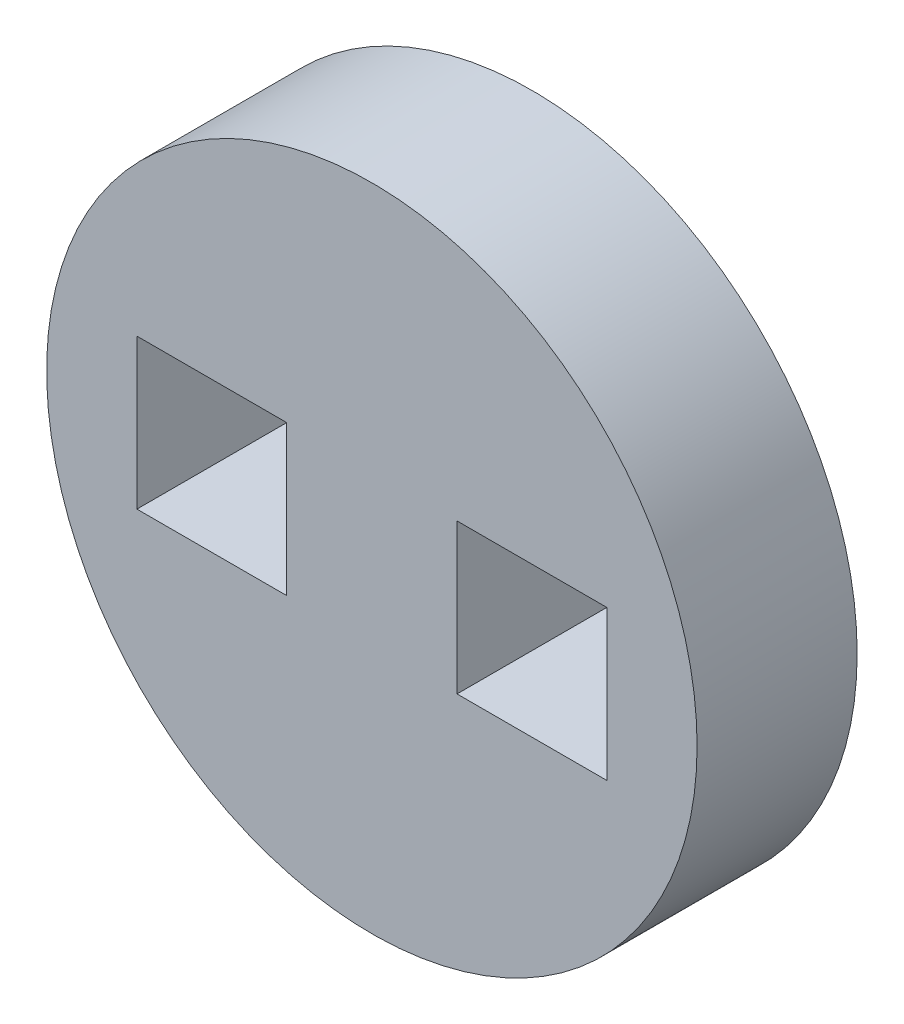
ISO-10303-21;
HEADER;
FILE_DESCRIPTION(('STEP AP214'),'2;1');
FILE_NAME('part.step','',(''),(''),'','','');
FILE_SCHEMA(('AUTOMOTIVE_DESIGN { 1 0 10303 214 1 1 1 1 }'));
ENDSEC;
DATA;
#1=APPLICATION_CONTEXT('core data for automotive mechanical design processes');
#2=APPLICATION_PROTOCOL_DEFINITION('international standard','automotive_design',2000,#1);
#3=PRODUCT_CONTEXT('',#1,'mechanical');
#4=PRODUCT('Part','Part','',(#3));
#5=PRODUCT_RELATED_PRODUCT_CATEGORY('part','',(#4));
#6=PRODUCT_DEFINITION_FORMATION('','',#4);
#7=PRODUCT_DEFINITION_CONTEXT('part definition',#1,'design');
#8=PRODUCT_DEFINITION('design','',#6,#7);
#9=PRODUCT_DEFINITION_SHAPE('','',#8);
#10=(LENGTH_UNIT() NAMED_UNIT(*) SI_UNIT(.MILLI.,.METRE.));
#11=(NAMED_UNIT(*) PLANE_ANGLE_UNIT() SI_UNIT($,.RADIAN.));
#12=(NAMED_UNIT(*) SI_UNIT($,.STERADIAN.) SOLID_ANGLE_UNIT());
#13=UNCERTAINTY_MEASURE_WITH_UNIT(LENGTH_MEASURE(1.E-05),#10,'distance_accuracy_value','');
#14=(GEOMETRIC_REPRESENTATION_CONTEXT(3) GLOBAL_UNCERTAINTY_ASSIGNED_CONTEXT((#13)) GLOBAL_UNIT_ASSIGNED_CONTEXT((#10,
#11,#12)) REPRESENTATION_CONTEXT('',''));
#15=CARTESIAN_POINT('',(0.,0.,0.));
#16=DIRECTION('',(0.,0.,1.));
#17=DIRECTION('',(1.,0.,0.));
#18=AXIS2_PLACEMENT_3D('',#15,#16,#17);
#19=CARTESIAN_POINT('',(0.,0.,3.175));
#20=DIRECTION('',(0.,0.,1.));
#21=DIRECTION('',(1.,0.,0.));
#22=AXIS2_PLACEMENT_3D('',#19,#20,#21);
#23=PLANE('',#22);
#24=CARTESIAN_POINT('',(0.,0.,3.175));
#25=DIRECTION('',(0.,0.,1.));
#26=DIRECTION('',(1.,0.,0.));
#27=AXIS2_PLACEMENT_3D('',#24,#25,#26);
#28=CIRCLE('',#27,6.4516);
#29=CARTESIAN_POINT('',(6.4516,0.,3.175));
#30=VERTEX_POINT('',#29);
#31=EDGE_CURVE('E12',#30,#30,#28,.T.);
#32=ORIENTED_EDGE('',*,*,#31,.T.);
#33=EDGE_LOOP('',(#32));
#34=FACE_BOUND('',#33,.T.);
#35=DIRECTION('',(0.,1.,0.));
#36=VECTOR('',#35,1.);
#37=CARTESIAN_POINT('',(-1.6891,-1.4859,3.175));
#38=LINE('',#37,#36);
#39=CARTESIAN_POINT('',(-1.6891,-1.4859,3.175));
#40=VERTEX_POINT('',#39);
#41=CARTESIAN_POINT('',(-1.6891,1.4859,3.175));
#42=VERTEX_POINT('',#41);
#43=EDGE_CURVE('E155',#40,#42,#38,.T.);
#44=ORIENTED_EDGE('',*,*,#43,.F.);
#45=DIRECTION('',(1.,0.,0.));
#46=VECTOR('',#45,1.);
#47=CARTESIAN_POINT('',(-4.6609,-1.4859,3.175));
#48=LINE('',#47,#46);
#49=CARTESIAN_POINT('',(-4.6609,-1.4859,3.175));
#50=VERTEX_POINT('',#49);
#51=EDGE_CURVE('E151',#50,#40,#48,.T.);
#52=ORIENTED_EDGE('',*,*,#51,.F.);
#53=DIRECTION('',(0.,-1.,0.));
#54=VECTOR('',#53,1.);
#55=CARTESIAN_POINT('',(-4.6609,-1.4859,3.175));
#56=LINE('',#55,#54);
#57=CARTESIAN_POINT('',(-4.6609,1.4859,3.175));
#58=VERTEX_POINT('',#57);
#59=EDGE_CURVE('E162',#58,#50,#56,.T.);
#60=ORIENTED_EDGE('',*,*,#59,.F.);
#61=DIRECTION('',(-1.,0.,0.));
#62=VECTOR('',#61,1.);
#63=CARTESIAN_POINT('',(-4.6609,1.4859,3.175));
#64=LINE('',#63,#62);
#65=EDGE_CURVE('E167',#42,#58,#64,.T.);
#66=ORIENTED_EDGE('',*,*,#65,.F.);
#67=EDGE_LOOP('',(#44,#52,#60,#66));
#68=FACE_BOUND('',#67,.T.);
#69=DIRECTION('',(0.,1.,0.));
#70=VECTOR('',#69,1.);
#71=CARTESIAN_POINT('',(4.6609,-1.4859,3.175));
#72=LINE('',#71,#70);
#73=CARTESIAN_POINT('',(4.6609,-1.4859,3.175));
#74=VERTEX_POINT('',#73);
#75=CARTESIAN_POINT('',(4.6609,1.4859,3.175));
#76=VERTEX_POINT('',#75);
#77=EDGE_CURVE('E111',#74,#76,#72,.T.);
#78=ORIENTED_EDGE('',*,*,#77,.F.);
#79=DIRECTION('',(1.,0.,0.));
#80=VECTOR('',#79,1.);
#81=CARTESIAN_POINT('',(1.6891,-1.4859,3.175));
#82=LINE('',#81,#80);
#83=CARTESIAN_POINT('',(1.6891,-1.4859,3.175));
#84=VERTEX_POINT('',#83);
#85=EDGE_CURVE('E102',#84,#74,#82,.T.);
#86=ORIENTED_EDGE('',*,*,#85,.F.);
#87=DIRECTION('',(0.,-1.,0.));
#88=VECTOR('',#87,1.);
#89=CARTESIAN_POINT('',(1.6891,-1.4859,3.175));
#90=LINE('',#89,#88);
#91=CARTESIAN_POINT('',(1.6891,1.4859,3.175));
#92=VERTEX_POINT('',#91);
#93=EDGE_CURVE('E128',#92,#84,#90,.T.);
#94=ORIENTED_EDGE('',*,*,#93,.F.);
#95=DIRECTION('',(-1.,0.,0.));
#96=VECTOR('',#95,1.);
#97=CARTESIAN_POINT('',(1.6891,1.4859,3.175));
#98=LINE('',#97,#96);
#99=EDGE_CURVE('E123',#76,#92,#98,.T.);
#100=ORIENTED_EDGE('',*,*,#99,.F.);
#101=EDGE_LOOP('',(#78,#86,#94,#100));
#102=FACE_BOUND('',#101,.T.);
#103=ADVANCED_FACE('F36',(#34,#68,#102),#23,.T.);
#104=CARTESIAN_POINT('',(0.,0.,0.));
#105=DIRECTION('',(0.,0.,1.));
#106=DIRECTION('',(1.,0.,0.));
#107=AXIS2_PLACEMENT_3D('',#104,#105,#106);
#108=PLANE('',#107);
#109=DIRECTION('',(1.,0.,0.));
#110=VECTOR('',#109,1.);
#111=CARTESIAN_POINT('',(-4.6609,-1.4859,0.));
#112=LINE('',#111,#110);
#113=CARTESIAN_POINT('',(-4.6609,-1.4859,0.));
#114=VERTEX_POINT('',#113);
#115=CARTESIAN_POINT('',(-1.6891,-1.4859,0.));
#116=VERTEX_POINT('',#115);
#117=EDGE_CURVE('E119',#114,#116,#112,.T.);
#118=ORIENTED_EDGE('',*,*,#117,.T.);
#119=DIRECTION('',(0.,1.,0.));
#120=VECTOR('',#119,1.);
#121=CARTESIAN_POINT('',(-1.6891,-1.4859,0.));
#122=LINE('',#121,#120);
#123=CARTESIAN_POINT('',(-1.6891,1.4859,0.));
#124=VERTEX_POINT('',#123);
#125=EDGE_CURVE('E171',#116,#124,#122,.T.);
#126=ORIENTED_EDGE('',*,*,#125,.T.);
#127=DIRECTION('',(-1.,0.,0.));
#128=VECTOR('',#127,1.);
#129=CARTESIAN_POINT('',(-4.6609,1.4859,0.));
#130=LINE('',#129,#128);
#131=CARTESIAN_POINT('',(-4.6609,1.4859,0.));
#132=VERTEX_POINT('',#131);
#133=EDGE_CURVE('E174',#124,#132,#130,.T.);
#134=ORIENTED_EDGE('',*,*,#133,.T.);
#135=DIRECTION('',(0.,-1.,0.));
#136=VECTOR('',#135,1.);
#137=CARTESIAN_POINT('',(-4.6609,-1.4859,0.));
#138=LINE('',#137,#136);
#139=EDGE_CURVE('E156',#132,#114,#138,.T.);
#140=ORIENTED_EDGE('',*,*,#139,.T.);
#141=EDGE_LOOP('',(#118,#126,#134,#140));
#142=FACE_BOUND('',#141,.T.);
#143=CARTESIAN_POINT('',(0.,0.,0.));
#144=DIRECTION('',(0.,0.,1.));
#145=DIRECTION('',(1.,0.,0.));
#146=AXIS2_PLACEMENT_3D('',#143,#144,#145);
#147=CIRCLE('',#146,6.4516);
#148=CARTESIAN_POINT('',(6.4516,0.,0.));
#149=VERTEX_POINT('',#148);
#150=EDGE_CURVE('E40',#149,#149,#147,.T.);
#151=ORIENTED_EDGE('',*,*,#150,.F.);
#152=EDGE_LOOP('',(#151));
#153=FACE_BOUND('',#152,.T.);
#154=DIRECTION('',(1.,0.,0.));
#155=VECTOR('',#154,1.);
#156=CARTESIAN_POINT('',(1.6891,-1.4859,0.));
#157=LINE('',#156,#155);
#158=CARTESIAN_POINT('',(1.6891,-1.4859,0.));
#159=VERTEX_POINT('',#158);
#160=CARTESIAN_POINT('',(4.6609,-1.4859,0.));
#161=VERTEX_POINT('',#160);
#162=EDGE_CURVE('E60',#159,#161,#157,.T.);
#163=ORIENTED_EDGE('',*,*,#162,.T.);
#164=DIRECTION('',(0.,1.,0.));
#165=VECTOR('',#164,1.);
#166=CARTESIAN_POINT('',(4.6609,-1.4859,0.));
#167=LINE('',#166,#165);
#168=CARTESIAN_POINT('',(4.6609,1.4859,0.));
#169=VERTEX_POINT('',#168);
#170=EDGE_CURVE('E118',#161,#169,#167,.T.);
#171=ORIENTED_EDGE('',*,*,#170,.T.);
#172=DIRECTION('',(-1.,0.,0.));
#173=VECTOR('',#172,1.);
#174=CARTESIAN_POINT('',(1.6891,1.4859,0.));
#175=LINE('',#174,#173);
#176=CARTESIAN_POINT('',(1.6891,1.4859,0.));
#177=VERTEX_POINT('',#176);
#178=EDGE_CURVE('E143',#169,#177,#175,.T.);
#179=ORIENTED_EDGE('',*,*,#178,.T.);
#180=DIRECTION('',(0.,-1.,0.));
#181=VECTOR('',#180,1.);
#182=CARTESIAN_POINT('',(1.6891,-1.4859,0.));
#183=LINE('',#182,#181);
#184=EDGE_CURVE('E112',#177,#159,#183,.T.);
#185=ORIENTED_EDGE('',*,*,#184,.T.);
#186=EDGE_LOOP('',(#163,#171,#179,#185));
#187=FACE_BOUND('',#186,.T.);
#188=ADVANCED_FACE('F194',(#142,#153,#187),#108,.F.);
#189=CARTESIAN_POINT('',(0.,0.,3.175));
#190=DIRECTION('',(0.,0.,-1.));
#191=DIRECTION('',(-1.,0.,0.));
#192=AXIS2_PLACEMENT_3D('',#189,#190,#191);
#193=CYLINDRICAL_SURFACE('',#192,6.4516);
#194=ORIENTED_EDGE('',*,*,#31,.F.);
#195=EDGE_LOOP('',(#194));
#196=FACE_BOUND('',#195,.T.);
#197=ORIENTED_EDGE('',*,*,#150,.T.);
#198=EDGE_LOOP('',(#197));
#199=FACE_BOUND('',#198,.T.);
#200=ADVANCED_FACE('F38',(#196,#199),#193,.T.);
#201=CARTESIAN_POINT('',(-4.6609,-1.4859,3.175));
#202=DIRECTION('',(0.,1.,0.));
#203=DIRECTION('',(0.,0.,1.));
#204=AXIS2_PLACEMENT_3D('',#201,#202,#203);
#205=PLANE('',#204);
#206=ORIENTED_EDGE('',*,*,#117,.F.);
#207=DIRECTION('',(0.,0.,-1.));
#208=VECTOR('',#207,1.);
#209=CARTESIAN_POINT('',(-4.6609,-1.4859,3.175));
#210=LINE('',#209,#208);
#211=EDGE_CURVE('E166',#50,#114,#210,.T.);
#212=ORIENTED_EDGE('',*,*,#211,.F.);
#213=ORIENTED_EDGE('',*,*,#51,.T.);
#214=DIRECTION('',(0.,0.,-1.));
#215=VECTOR('',#214,1.);
#216=CARTESIAN_POINT('',(-1.6891,-1.4859,3.175));
#217=LINE('',#216,#215);
#218=EDGE_CURVE('E185',#40,#116,#217,.T.);
#219=ORIENTED_EDGE('',*,*,#218,.T.);
#220=EDGE_LOOP('',(#206,#212,#213,#219));
#221=FACE_BOUND('',#220,.T.);
#222=ADVANCED_FACE('F215',(#221),#205,.T.);
#223=CARTESIAN_POINT('',(-1.6891,-1.4859,3.175));
#224=DIRECTION('',(-1.,0.,0.));
#225=DIRECTION('',(0.,-1.,0.));
#226=AXIS2_PLACEMENT_3D('',#223,#224,#225);
#227=PLANE('',#226);
#228=ORIENTED_EDGE('',*,*,#125,.F.);
#229=ORIENTED_EDGE('',*,*,#218,.F.);
#230=ORIENTED_EDGE('',*,*,#43,.T.);
#231=DIRECTION('',(0.,0.,-1.));
#232=VECTOR('',#231,1.);
#233=CARTESIAN_POINT('',(-1.6891,1.4859,3.175));
#234=LINE('',#233,#232);
#235=EDGE_CURVE('E183',#42,#124,#234,.T.);
#236=ORIENTED_EDGE('',*,*,#235,.T.);
#237=EDGE_LOOP('',(#228,#229,#230,#236));
#238=FACE_BOUND('',#237,.T.);
#239=ADVANCED_FACE('F218',(#238),#227,.T.);
#240=CARTESIAN_POINT('',(-4.6609,1.4859,3.175));
#241=DIRECTION('',(0.,-1.,0.));
#242=DIRECTION('',(1.,0.,0.));
#243=AXIS2_PLACEMENT_3D('',#240,#241,#242);
#244=PLANE('',#243);
#245=ORIENTED_EDGE('',*,*,#133,.F.);
#246=ORIENTED_EDGE('',*,*,#235,.F.);
#247=ORIENTED_EDGE('',*,*,#65,.T.);
#248=DIRECTION('',(0.,0.,-1.));
#249=VECTOR('',#248,1.);
#250=CARTESIAN_POINT('',(-4.6609,1.4859,3.175));
#251=LINE('',#250,#249);
#252=EDGE_CURVE('E181',#58,#132,#251,.T.);
#253=ORIENTED_EDGE('',*,*,#252,.T.);
#254=EDGE_LOOP('',(#245,#246,#247,#253));
#255=FACE_BOUND('',#254,.T.);
#256=ADVANCED_FACE('F221',(#255),#244,.T.);
#257=CARTESIAN_POINT('',(-4.6609,-1.4859,3.175));
#258=DIRECTION('',(1.,0.,0.));
#259=DIRECTION('',(0.,0.,-1.));
#260=AXIS2_PLACEMENT_3D('',#257,#258,#259);
#261=PLANE('',#260);
#262=ORIENTED_EDGE('',*,*,#139,.F.);
#263=ORIENTED_EDGE('',*,*,#252,.F.);
#264=ORIENTED_EDGE('',*,*,#59,.T.);
#265=ORIENTED_EDGE('',*,*,#211,.T.);
#266=EDGE_LOOP('',(#262,#263,#264,#265));
#267=FACE_BOUND('',#266,.T.);
#268=ADVANCED_FACE('F225',(#267),#261,.T.);
#269=CARTESIAN_POINT('',(1.6891,-1.4859,3.175));
#270=DIRECTION('',(0.,1.,0.));
#271=DIRECTION('',(0.,0.,1.));
#272=AXIS2_PLACEMENT_3D('',#269,#270,#271);
#273=PLANE('',#272);
#274=ORIENTED_EDGE('',*,*,#162,.F.);
#275=DIRECTION('',(0.,0.,-1.));
#276=VECTOR('',#275,1.);
#277=CARTESIAN_POINT('',(1.6891,-1.4859,3.175));
#278=LINE('',#277,#276);
#279=EDGE_CURVE('E106',#84,#159,#278,.T.);
#280=ORIENTED_EDGE('',*,*,#279,.F.);
#281=ORIENTED_EDGE('',*,*,#85,.T.);
#282=DIRECTION('',(0.,0.,-1.));
#283=VECTOR('',#282,1.);
#284=CARTESIAN_POINT('',(4.6609,-1.4859,3.175));
#285=LINE('',#284,#283);
#286=EDGE_CURVE('E105',#74,#161,#285,.T.);
#287=ORIENTED_EDGE('',*,*,#286,.T.);
#288=EDGE_LOOP('',(#274,#280,#281,#287));
#289=FACE_BOUND('',#288,.T.);
#290=ADVANCED_FACE('F104',(#289),#273,.T.);
#291=CARTESIAN_POINT('',(4.6609,-1.4859,3.175));
#292=DIRECTION('',(-1.,0.,0.));
#293=DIRECTION('',(0.,0.,1.));
#294=AXIS2_PLACEMENT_3D('',#291,#292,#293);
#295=PLANE('',#294);
#296=ORIENTED_EDGE('',*,*,#170,.F.);
#297=ORIENTED_EDGE('',*,*,#286,.F.);
#298=ORIENTED_EDGE('',*,*,#77,.T.);
#299=DIRECTION('',(0.,0.,-1.));
#300=VECTOR('',#299,1.);
#301=CARTESIAN_POINT('',(4.6609,1.4859,3.175));
#302=LINE('',#301,#300);
#303=EDGE_CURVE('E120',#76,#169,#302,.T.);
#304=ORIENTED_EDGE('',*,*,#303,.T.);
#305=EDGE_LOOP('',(#296,#297,#298,#304));
#306=FACE_BOUND('',#305,.T.);
#307=ADVANCED_FACE('F115',(#306),#295,.T.);
#308=CARTESIAN_POINT('',(1.6891,1.4859,3.175));
#309=DIRECTION('',(0.,-1.,0.));
#310=DIRECTION('',(1.,0.,0.));
#311=AXIS2_PLACEMENT_3D('',#308,#309,#310);
#312=PLANE('',#311);
#313=ORIENTED_EDGE('',*,*,#178,.F.);
#314=ORIENTED_EDGE('',*,*,#303,.F.);
#315=ORIENTED_EDGE('',*,*,#99,.T.);
#316=DIRECTION('',(0.,0.,-1.));
#317=VECTOR('',#316,1.);
#318=CARTESIAN_POINT('',(1.6891,1.4859,3.175));
#319=LINE('',#318,#317);
#320=EDGE_CURVE('E52',#92,#177,#319,.T.);
#321=ORIENTED_EDGE('',*,*,#320,.T.);
#322=EDGE_LOOP('',(#313,#314,#315,#321));
#323=FACE_BOUND('',#322,.T.);
#324=ADVANCED_FACE('F201',(#323),#312,.T.);
#325=CARTESIAN_POINT('',(1.6891,-1.4859,3.175));
#326=DIRECTION('',(1.,0.,0.));
#327=DIRECTION('',(0.,0.,-1.));
#328=AXIS2_PLACEMENT_3D('',#325,#326,#327);
#329=PLANE('',#328);
#330=ORIENTED_EDGE('',*,*,#184,.F.);
#331=ORIENTED_EDGE('',*,*,#320,.F.);
#332=ORIENTED_EDGE('',*,*,#93,.T.);
#333=ORIENTED_EDGE('',*,*,#279,.T.);
#334=EDGE_LOOP('',(#330,#331,#332,#333));
#335=FACE_BOUND('',#334,.T.);
#336=ADVANCED_FACE('F199',(#335),#329,.T.);
#337=CLOSED_SHELL('',(#103,#188,#200,#222,#239,#256,#268,#290,#307,#324,#336));
#338=MANIFOLD_SOLID_BREP('B2',#337);
#339=ADVANCED_BREP_SHAPE_REPRESENTATION('',(#18,#338),#14);
#340=SHAPE_DEFINITION_REPRESENTATION(#9,#339);
ENDSEC;
END-ISO-10303-21;
